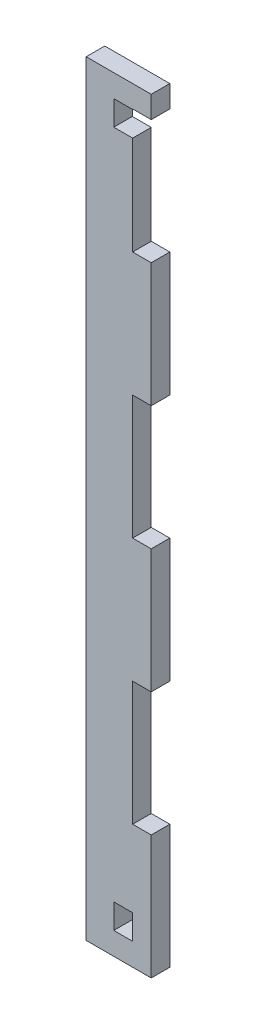
ISO-10303-21;
HEADER;
FILE_DESCRIPTION(('STEP AP214'),'2;1');
FILE_NAME('part.step','',(''),(''),'','','');
FILE_SCHEMA(('AUTOMOTIVE_DESIGN { 1 0 10303 214 1 1 1 1 }'));
ENDSEC;
DATA;
#1=APPLICATION_CONTEXT('core data for automotive mechanical design processes');
#2=APPLICATION_PROTOCOL_DEFINITION('international standard','automotive_design',2000,#1);
#3=PRODUCT_CONTEXT('',#1,'mechanical');
#4=PRODUCT('Part','Part','',(#3));
#5=PRODUCT_RELATED_PRODUCT_CATEGORY('part','',(#4));
#6=PRODUCT_DEFINITION_FORMATION('','',#4);
#7=PRODUCT_DEFINITION_CONTEXT('part definition',#1,'design');
#8=PRODUCT_DEFINITION('design','',#6,#7);
#9=PRODUCT_DEFINITION_SHAPE('','',#8);
#10=(LENGTH_UNIT() NAMED_UNIT(*) SI_UNIT(.MILLI.,.METRE.));
#11=(NAMED_UNIT(*) PLANE_ANGLE_UNIT() SI_UNIT($,.RADIAN.));
#12=(NAMED_UNIT(*) SI_UNIT($,.STERADIAN.) SOLID_ANGLE_UNIT());
#13=UNCERTAINTY_MEASURE_WITH_UNIT(LENGTH_MEASURE(1.E-05),#10,'distance_accuracy_value','');
#14=(GEOMETRIC_REPRESENTATION_CONTEXT(3) GLOBAL_UNCERTAINTY_ASSIGNED_CONTEXT((#13)) GLOBAL_UNIT_ASSIGNED_CONTEXT((#10,
#11,#12)) REPRESENTATION_CONTEXT('',''));
#15=CARTESIAN_POINT('',(0.,0.,0.));
#16=DIRECTION('',(0.,0.,1.));
#17=DIRECTION('',(1.,0.,0.));
#18=AXIS2_PLACEMENT_3D('',#15,#16,#17);
#19=CARTESIAN_POINT('',(0.,0.,6.));
#20=DIRECTION('',(0.,0.,1.));
#21=DIRECTION('',(1.,0.,0.));
#22=AXIS2_PLACEMENT_3D('',#19,#20,#21);
#23=PLANE('',#22);
#24=DIRECTION('',(0.,-1.,0.));
#25=VECTOR('',#24,1.);
#26=CARTESIAN_POINT('',(-15.,181.409908734667,6.));
#27=LINE('',#26,#25);
#28=CARTESIAN_POINT('',(-15.,181.409908734667,6.));
#29=VERTEX_POINT('',#28);
#30=CARTESIAN_POINT('',(-14.9999999999999,-65.6931909968825,6.));
#31=VERTEX_POINT('',#30);
#32=EDGE_CURVE('E229',#29,#31,#27,.T.);
#33=ORIENTED_EDGE('',*,*,#32,.T.);
#34=DIRECTION('',(1.,0.,0.));
#35=VECTOR('',#34,1.);
#36=CARTESIAN_POINT('',(-14.9999999999999,-65.6931909968825,6.));
#37=LINE('',#36,#35);
#38=CARTESIAN_POINT('',(6.,-65.6931909968825,6.));
#39=VERTEX_POINT('',#38);
#40=EDGE_CURVE('E232',#31,#39,#37,.T.);
#41=ORIENTED_EDGE('',*,*,#40,.T.);
#42=DIRECTION('',(0.,1.,0.));
#43=VECTOR('',#42,1.);
#44=CARTESIAN_POINT('',(6.,-25.6919761374717,6.));
#45=LINE('',#44,#43);
#46=CARTESIAN_POINT('',(6.,-25.6919761374717,6.));
#47=VERTEX_POINT('',#46);
#48=EDGE_CURVE('E235',#39,#47,#45,.T.);
#49=ORIENTED_EDGE('',*,*,#48,.T.);
#50=DIRECTION('',(-1.,0.,0.));
#51=VECTOR('',#50,1.);
#52=CARTESIAN_POINT('',(0.,-25.6919761374717,6.));
#53=LINE('',#52,#51);
#54=CARTESIAN_POINT('',(0.,-25.6919761374717,6.));
#55=VERTEX_POINT('',#54);
#56=EDGE_CURVE('E237',#47,#55,#53,.T.);
#57=ORIENTED_EDGE('',*,*,#56,.T.);
#58=DIRECTION('',(0.,1.,0.));
#59=VECTOR('',#58,1.);
#60=CARTESIAN_POINT('',(0.,14.3068090031147,6.));
#61=LINE('',#60,#59);
#62=CARTESIAN_POINT('',(0.,14.3068090031147,6.));
#63=VERTEX_POINT('',#62);
#64=EDGE_CURVE('E239',#55,#63,#61,.T.);
#65=ORIENTED_EDGE('',*,*,#64,.T.);
#66=DIRECTION('',(1.,0.,0.));
#67=VECTOR('',#66,1.);
#68=CARTESIAN_POINT('',(6.,14.3068090031147,6.));
#69=LINE('',#68,#67);
#70=CARTESIAN_POINT('',(6.,14.3068090031147,6.));
#71=VERTEX_POINT('',#70);
#72=EDGE_CURVE('E241',#63,#71,#69,.T.);
#73=ORIENTED_EDGE('',*,*,#72,.T.);
#74=DIRECTION('',(0.,1.,0.));
#75=VECTOR('',#74,1.);
#76=CARTESIAN_POINT('',(6.,54.308631292235,6.));
#77=LINE('',#76,#75);
#78=CARTESIAN_POINT('',(6.,54.308631292235,6.));
#79=VERTEX_POINT('',#78);
#80=EDGE_CURVE('E243',#71,#79,#77,.T.);
#81=ORIENTED_EDGE('',*,*,#80,.T.);
#82=DIRECTION('',(-1.,0.,0.));
#83=VECTOR('',#82,1.);
#84=CARTESIAN_POINT('',(0.,54.308631292235,6.));
#85=LINE('',#84,#83);
#86=CARTESIAN_POINT('',(0.,54.308631292235,6.));
#87=VERTEX_POINT('',#86);
#88=EDGE_CURVE('E245',#79,#87,#85,.T.);
#89=ORIENTED_EDGE('',*,*,#88,.T.);
#90=DIRECTION('',(0.,1.,0.));
#91=VECTOR('',#90,1.);
#92=CARTESIAN_POINT('',(0.,94.3074164328215,6.));
#93=LINE('',#92,#91);
#94=CARTESIAN_POINT('',(0.,94.3074164328215,6.));
#95=VERTEX_POINT('',#94);
#96=EDGE_CURVE('E247',#87,#95,#93,.T.);
#97=ORIENTED_EDGE('',*,*,#96,.T.);
#98=DIRECTION('',(1.,0.,0.));
#99=VECTOR('',#98,1.);
#100=CARTESIAN_POINT('',(6.,94.3074164328215,6.));
#101=LINE('',#100,#99);
#102=CARTESIAN_POINT('',(6.,94.3074164328215,6.));
#103=VERTEX_POINT('',#102);
#104=EDGE_CURVE('E249',#95,#103,#101,.T.);
#105=ORIENTED_EDGE('',*,*,#104,.T.);
#106=DIRECTION('',(0.,1.,0.));
#107=VECTOR('',#106,1.);
#108=CARTESIAN_POINT('',(6.,134.309238721942,6.));
#109=LINE('',#108,#107);
#110=CARTESIAN_POINT('',(6.,134.309238721942,6.));
#111=VERTEX_POINT('',#110);
#112=EDGE_CURVE('E251',#103,#111,#109,.T.);
#113=ORIENTED_EDGE('',*,*,#112,.T.);
#114=DIRECTION('',(-1.,0.,0.));
#115=VECTOR('',#114,1.);
#116=CARTESIAN_POINT('',(0.,134.309238721942,6.));
#117=LINE('',#116,#115);
#118=CARTESIAN_POINT('',(0.,134.309238721942,6.));
#119=VERTEX_POINT('',#118);
#120=EDGE_CURVE('E253',#111,#119,#117,.T.);
#121=ORIENTED_EDGE('',*,*,#120,.T.);
#122=DIRECTION('',(0.,1.,0.));
#123=VECTOR('',#122,1.);
#124=CARTESIAN_POINT('',(0.,166.159908734665,6.));
#125=LINE('',#124,#123);
#126=CARTESIAN_POINT('',(0.,166.159908734665,6.));
#127=VERTEX_POINT('',#126);
#128=EDGE_CURVE('E255',#119,#127,#125,.T.);
#129=ORIENTED_EDGE('',*,*,#128,.T.);
#130=DIRECTION('',(-1.,0.,0.));
#131=VECTOR('',#130,1.);
#132=CARTESIAN_POINT('',(0.,166.159908734665,6.));
#133=LINE('',#132,#131);
#134=CARTESIAN_POINT('',(-6.1,166.159908734665,6.));
#135=VERTEX_POINT('',#134);
#136=EDGE_CURVE('E257',#127,#135,#133,.T.);
#137=ORIENTED_EDGE('',*,*,#136,.T.);
#138=DIRECTION('',(0.,1.,0.));
#139=VECTOR('',#138,1.);
#140=CARTESIAN_POINT('',(-6.1,166.159908734665,6.));
#141=LINE('',#140,#139);
#142=CARTESIAN_POINT('',(-6.1,174.159908734665,6.));
#143=VERTEX_POINT('',#142);
#144=EDGE_CURVE('E259',#135,#143,#141,.T.);
#145=ORIENTED_EDGE('',*,*,#144,.T.);
#146=DIRECTION('',(1.,0.,0.));
#147=VECTOR('',#146,1.);
#148=CARTESIAN_POINT('',(0.,174.159908734665,6.));
#149=LINE('',#148,#147);
#150=CARTESIAN_POINT('',(0.,174.159908734665,6.));
#151=VERTEX_POINT('',#150);
#152=EDGE_CURVE('E261',#143,#151,#149,.T.);
#153=ORIENTED_EDGE('',*,*,#152,.T.);
#154=DIRECTION('',(0.,1.,0.));
#155=VECTOR('',#154,1.);
#156=CARTESIAN_POINT('',(0.,174.308023862528,6.));
#157=LINE('',#156,#155);
#158=CARTESIAN_POINT('',(0.,174.308023862528,6.));
#159=VERTEX_POINT('',#158);
#160=EDGE_CURVE('E263',#151,#159,#157,.T.);
#161=ORIENTED_EDGE('',*,*,#160,.T.);
#162=DIRECTION('',(1.,0.,0.));
#163=VECTOR('',#162,1.);
#164=CARTESIAN_POINT('',(6.,174.308023862528,6.));
#165=LINE('',#164,#163);
#166=CARTESIAN_POINT('',(6.,174.308023862528,6.));
#167=VERTEX_POINT('',#166);
#168=EDGE_CURVE('E265',#159,#167,#165,.T.);
#169=ORIENTED_EDGE('',*,*,#168,.T.);
#170=DIRECTION('',(0.,1.,0.));
#171=VECTOR('',#170,1.);
#172=CARTESIAN_POINT('',(5.99999999999997,181.409908734667,6.));
#173=LINE('',#172,#171);
#174=CARTESIAN_POINT('',(5.99999999999997,181.409908734667,6.));
#175=VERTEX_POINT('',#174);
#176=EDGE_CURVE('E267',#167,#175,#173,.T.);
#177=ORIENTED_EDGE('',*,*,#176,.T.);
#178=DIRECTION('',(-1.,0.,0.));
#179=VECTOR('',#178,1.);
#180=CARTESIAN_POINT('',(-15.,181.409908734667,6.));
#181=LINE('',#180,#179);
#182=EDGE_CURVE('E269',#175,#29,#181,.T.);
#183=ORIENTED_EDGE('',*,*,#182,.T.);
#184=EDGE_LOOP('',(#33,#41,#49,#57,#65,#73,#81,#89,#97,#105,#113,#121,#129,#137,#145,#153,#161,
#169,#177,#183));
#185=FACE_BOUND('',#184,.T.);
#186=DIRECTION('',(-1.,0.,0.));
#187=VECTOR('',#186,1.);
#188=CARTESIAN_POINT('',(0.,-50.4431909968838,6.));
#189=LINE('',#188,#187);
#190=CARTESIAN_POINT('',(0.,-50.4431909968838,6.));
#191=VERTEX_POINT('',#190);
#192=CARTESIAN_POINT('',(-6.1,-50.4431909968838,6.));
#193=VERTEX_POINT('',#192);
#194=EDGE_CURVE('E201',#191,#193,#189,.T.);
#195=ORIENTED_EDGE('',*,*,#194,.F.);
#196=DIRECTION('',(0.,1.,0.));
#197=VECTOR('',#196,1.);
#198=CARTESIAN_POINT('',(0.,-58.443190996884,6.));
#199=LINE('',#198,#197);
#200=CARTESIAN_POINT('',(0.,-58.443190996884,6.));
#201=VERTEX_POINT('',#200);
#202=EDGE_CURVE('E193',#201,#191,#199,.T.);
#203=ORIENTED_EDGE('',*,*,#202,.F.);
#204=DIRECTION('',(1.,0.,0.));
#205=VECTOR('',#204,1.);
#206=CARTESIAN_POINT('',(0.,-58.443190996884,6.));
#207=LINE('',#206,#205);
#208=CARTESIAN_POINT('',(-6.1,-58.443190996884,6.));
#209=VERTEX_POINT('',#208);
#210=EDGE_CURVE('E215',#209,#201,#207,.T.);
#211=ORIENTED_EDGE('',*,*,#210,.F.);
#212=DIRECTION('',(0.,-1.,0.));
#213=VECTOR('',#212,1.);
#214=CARTESIAN_POINT('',(-6.1,-50.4431909968838,6.));
#215=LINE('',#214,#213);
#216=EDGE_CURVE('E213',#193,#209,#215,.T.);
#217=ORIENTED_EDGE('',*,*,#216,.F.);
#218=EDGE_LOOP('',(#195,#203,#211,#217));
#219=FACE_BOUND('',#218,.T.);
#220=ADVANCED_FACE('F32',(#185,#219),#23,.T.);
#221=CARTESIAN_POINT('',(0.,0.,0.));
#222=DIRECTION('',(0.,0.,1.));
#223=DIRECTION('',(1.,0.,0.));
#224=AXIS2_PLACEMENT_3D('',#221,#222,#223);
#225=PLANE('',#224);
#226=DIRECTION('',(0.,-1.,0.));
#227=VECTOR('',#226,1.);
#228=CARTESIAN_POINT('',(-15.,181.409908734667,0.));
#229=LINE('',#228,#227);
#230=CARTESIAN_POINT('',(-15.,181.409908734667,0.));
#231=VERTEX_POINT('',#230);
#232=CARTESIAN_POINT('',(-14.9999999999999,-65.6931909968825,0.));
#233=VERTEX_POINT('',#232);
#234=EDGE_CURVE('E209',#231,#233,#229,.T.);
#235=ORIENTED_EDGE('',*,*,#234,.F.);
#236=DIRECTION('',(-1.,0.,0.));
#237=VECTOR('',#236,1.);
#238=CARTESIAN_POINT('',(-15.,181.409908734667,0.));
#239=LINE('',#238,#237);
#240=CARTESIAN_POINT('',(5.99999999999997,181.409908734667,0.));
#241=VERTEX_POINT('',#240);
#242=EDGE_CURVE('E233',#241,#231,#239,.T.);
#243=ORIENTED_EDGE('',*,*,#242,.F.);
#244=DIRECTION('',(0.,1.,0.));
#245=VECTOR('',#244,1.);
#246=CARTESIAN_POINT('',(5.99999999999997,181.409908734667,0.));
#247=LINE('',#246,#245);
#248=CARTESIAN_POINT('',(6.,174.308023862528,0.));
#249=VERTEX_POINT('',#248);
#250=EDGE_CURVE('E308',#249,#241,#247,.T.);
#251=ORIENTED_EDGE('',*,*,#250,.F.);
#252=DIRECTION('',(1.,0.,0.));
#253=VECTOR('',#252,1.);
#254=CARTESIAN_POINT('',(6.,174.308023862528,0.));
#255=LINE('',#254,#253);
#256=CARTESIAN_POINT('',(0.,174.308023862528,0.));
#257=VERTEX_POINT('',#256);
#258=EDGE_CURVE('E306',#257,#249,#255,.T.);
#259=ORIENTED_EDGE('',*,*,#258,.F.);
#260=DIRECTION('',(0.,1.,0.));
#261=VECTOR('',#260,1.);
#262=CARTESIAN_POINT('',(0.,174.308023862528,0.));
#263=LINE('',#262,#261);
#264=CARTESIAN_POINT('',(0.,174.159908734665,0.));
#265=VERTEX_POINT('',#264);
#266=EDGE_CURVE('E304',#265,#257,#263,.T.);
#267=ORIENTED_EDGE('',*,*,#266,.F.);
#268=DIRECTION('',(1.,0.,0.));
#269=VECTOR('',#268,1.);
#270=CARTESIAN_POINT('',(0.,174.159908734665,0.));
#271=LINE('',#270,#269);
#272=CARTESIAN_POINT('',(-6.1,174.159908734665,0.));
#273=VERTEX_POINT('',#272);
#274=EDGE_CURVE('E302',#273,#265,#271,.T.);
#275=ORIENTED_EDGE('',*,*,#274,.F.);
#276=DIRECTION('',(0.,1.,0.));
#277=VECTOR('',#276,1.);
#278=CARTESIAN_POINT('',(-6.1,166.159908734665,0.));
#279=LINE('',#278,#277);
#280=CARTESIAN_POINT('',(-6.1,166.159908734665,0.));
#281=VERTEX_POINT('',#280);
#282=EDGE_CURVE('E300',#281,#273,#279,.T.);
#283=ORIENTED_EDGE('',*,*,#282,.F.);
#284=DIRECTION('',(-1.,0.,0.));
#285=VECTOR('',#284,1.);
#286=CARTESIAN_POINT('',(0.,166.159908734665,0.));
#287=LINE('',#286,#285);
#288=CARTESIAN_POINT('',(0.,166.159908734665,0.));
#289=VERTEX_POINT('',#288);
#290=EDGE_CURVE('E298',#289,#281,#287,.T.);
#291=ORIENTED_EDGE('',*,*,#290,.F.);
#292=DIRECTION('',(0.,1.,0.));
#293=VECTOR('',#292,1.);
#294=CARTESIAN_POINT('',(0.,166.159908734665,0.));
#295=LINE('',#294,#293);
#296=CARTESIAN_POINT('',(0.,134.309238721942,0.));
#297=VERTEX_POINT('',#296);
#298=EDGE_CURVE('E296',#297,#289,#295,.T.);
#299=ORIENTED_EDGE('',*,*,#298,.F.);
#300=DIRECTION('',(-1.,0.,0.));
#301=VECTOR('',#300,1.);
#302=CARTESIAN_POINT('',(0.,134.309238721942,0.));
#303=LINE('',#302,#301);
#304=CARTESIAN_POINT('',(6.,134.309238721942,0.));
#305=VERTEX_POINT('',#304);
#306=EDGE_CURVE('E294',#305,#297,#303,.T.);
#307=ORIENTED_EDGE('',*,*,#306,.F.);
#308=DIRECTION('',(0.,1.,0.));
#309=VECTOR('',#308,1.);
#310=CARTESIAN_POINT('',(6.,134.309238721942,0.));
#311=LINE('',#310,#309);
#312=CARTESIAN_POINT('',(6.,94.3074164328215,0.));
#313=VERTEX_POINT('',#312);
#314=EDGE_CURVE('E292',#313,#305,#311,.T.);
#315=ORIENTED_EDGE('',*,*,#314,.F.);
#316=DIRECTION('',(1.,0.,0.));
#317=VECTOR('',#316,1.);
#318=CARTESIAN_POINT('',(6.,94.3074164328215,0.));
#319=LINE('',#318,#317);
#320=CARTESIAN_POINT('',(0.,94.3074164328215,0.));
#321=VERTEX_POINT('',#320);
#322=EDGE_CURVE('E290',#321,#313,#319,.T.);
#323=ORIENTED_EDGE('',*,*,#322,.F.);
#324=DIRECTION('',(0.,1.,0.));
#325=VECTOR('',#324,1.);
#326=CARTESIAN_POINT('',(0.,94.3074164328215,0.));
#327=LINE('',#326,#325);
#328=CARTESIAN_POINT('',(0.,54.308631292235,0.));
#329=VERTEX_POINT('',#328);
#330=EDGE_CURVE('E288',#329,#321,#327,.T.);
#331=ORIENTED_EDGE('',*,*,#330,.F.);
#332=DIRECTION('',(-1.,0.,0.));
#333=VECTOR('',#332,1.);
#334=CARTESIAN_POINT('',(0.,54.308631292235,0.));
#335=LINE('',#334,#333);
#336=CARTESIAN_POINT('',(6.,54.308631292235,0.));
#337=VERTEX_POINT('',#336);
#338=EDGE_CURVE('E286',#337,#329,#335,.T.);
#339=ORIENTED_EDGE('',*,*,#338,.F.);
#340=DIRECTION('',(0.,1.,0.));
#341=VECTOR('',#340,1.);
#342=CARTESIAN_POINT('',(6.,54.308631292235,0.));
#343=LINE('',#342,#341);
#344=CARTESIAN_POINT('',(6.,14.3068090031147,0.));
#345=VERTEX_POINT('',#344);
#346=EDGE_CURVE('E284',#345,#337,#343,.T.);
#347=ORIENTED_EDGE('',*,*,#346,.F.);
#348=DIRECTION('',(1.,0.,0.));
#349=VECTOR('',#348,1.);
#350=CARTESIAN_POINT('',(6.,14.3068090031147,0.));
#351=LINE('',#350,#349);
#352=CARTESIAN_POINT('',(0.,14.3068090031147,0.));
#353=VERTEX_POINT('',#352);
#354=EDGE_CURVE('E282',#353,#345,#351,.T.);
#355=ORIENTED_EDGE('',*,*,#354,.F.);
#356=DIRECTION('',(0.,1.,0.));
#357=VECTOR('',#356,1.);
#358=CARTESIAN_POINT('',(0.,14.3068090031147,0.));
#359=LINE('',#358,#357);
#360=CARTESIAN_POINT('',(0.,-25.6919761374717,0.));
#361=VERTEX_POINT('',#360);
#362=EDGE_CURVE('E280',#361,#353,#359,.T.);
#363=ORIENTED_EDGE('',*,*,#362,.F.);
#364=DIRECTION('',(-1.,0.,0.));
#365=VECTOR('',#364,1.);
#366=CARTESIAN_POINT('',(0.,-25.6919761374717,0.));
#367=LINE('',#366,#365);
#368=CARTESIAN_POINT('',(6.,-25.6919761374717,0.));
#369=VERTEX_POINT('',#368);
#370=EDGE_CURVE('E278',#369,#361,#367,.T.);
#371=ORIENTED_EDGE('',*,*,#370,.F.);
#372=DIRECTION('',(0.,1.,0.));
#373=VECTOR('',#372,1.);
#374=CARTESIAN_POINT('',(6.,-25.6919761374717,0.));
#375=LINE('',#374,#373);
#376=CARTESIAN_POINT('',(6.,-65.6931909968825,0.));
#377=VERTEX_POINT('',#376);
#378=EDGE_CURVE('E276',#377,#369,#375,.T.);
#379=ORIENTED_EDGE('',*,*,#378,.F.);
#380=DIRECTION('',(1.,0.,0.));
#381=VECTOR('',#380,1.);
#382=CARTESIAN_POINT('',(-14.9999999999999,-65.6931909968825,0.));
#383=LINE('',#382,#381);
#384=EDGE_CURVE('E274',#233,#377,#383,.T.);
#385=ORIENTED_EDGE('',*,*,#384,.F.);
#386=EDGE_LOOP('',(#235,#243,#251,#259,#267,#275,#283,#291,#299,#307,#315,#323,#331,#339,#347,
#355,#363,#371,#379,#385));
#387=FACE_BOUND('',#386,.T.);
#388=DIRECTION('',(0.,1.,0.));
#389=VECTOR('',#388,1.);
#390=CARTESIAN_POINT('',(0.,-58.443190996884,0.));
#391=LINE('',#390,#389);
#392=CARTESIAN_POINT('',(0.,-58.443190996884,0.));
#393=VERTEX_POINT('',#392);
#394=CARTESIAN_POINT('',(0.,-50.4431909968838,0.));
#395=VERTEX_POINT('',#394);
#396=EDGE_CURVE('E55',#393,#395,#391,.T.);
#397=ORIENTED_EDGE('',*,*,#396,.T.);
#398=DIRECTION('',(-1.,0.,0.));
#399=VECTOR('',#398,1.);
#400=CARTESIAN_POINT('',(0.,-50.4431909968838,0.));
#401=LINE('',#400,#399);
#402=CARTESIAN_POINT('',(-6.1,-50.4431909968838,0.));
#403=VERTEX_POINT('',#402);
#404=EDGE_CURVE('E208',#395,#403,#401,.T.);
#405=ORIENTED_EDGE('',*,*,#404,.T.);
#406=DIRECTION('',(0.,-1.,0.));
#407=VECTOR('',#406,1.);
#408=CARTESIAN_POINT('',(-6.1,-50.4431909968838,0.));
#409=LINE('',#408,#407);
#410=CARTESIAN_POINT('',(-6.1,-58.443190996884,0.));
#411=VERTEX_POINT('',#410);
#412=EDGE_CURVE('E221',#403,#411,#409,.T.);
#413=ORIENTED_EDGE('',*,*,#412,.T.);
#414=DIRECTION('',(1.,0.,0.));
#415=VECTOR('',#414,1.);
#416=CARTESIAN_POINT('',(0.,-58.443190996884,0.));
#417=LINE('',#416,#415);
#418=EDGE_CURVE('E202',#411,#393,#417,.T.);
#419=ORIENTED_EDGE('',*,*,#418,.T.);
#420=EDGE_LOOP('',(#397,#405,#413,#419));
#421=FACE_BOUND('',#420,.T.);
#422=ADVANCED_FACE('F374',(#387,#421),#225,.F.);
#423=CARTESIAN_POINT('',(-15.,181.409908734667,6.));
#424=DIRECTION('',(1.,0.,0.));
#425=DIRECTION('',(0.,1.,0.));
#426=AXIS2_PLACEMENT_3D('',#423,#424,#425);
#427=PLANE('',#426);
#428=ORIENTED_EDGE('',*,*,#234,.T.);
#429=DIRECTION('',(0.,0.,-1.));
#430=VECTOR('',#429,1.);
#431=CARTESIAN_POINT('',(-14.9999999999999,-65.6931909968825,6.));
#432=LINE('',#431,#430);
#433=EDGE_CURVE('E11',#31,#233,#432,.T.);
#434=ORIENTED_EDGE('',*,*,#433,.F.);
#435=ORIENTED_EDGE('',*,*,#32,.F.);
#436=DIRECTION('',(0.,0.,-1.));
#437=VECTOR('',#436,1.);
#438=CARTESIAN_POINT('',(-15.,181.409908734667,6.));
#439=LINE('',#438,#437);
#440=EDGE_CURVE('E271',#29,#231,#439,.T.);
#441=ORIENTED_EDGE('',*,*,#440,.T.);
#442=EDGE_LOOP('',(#428,#434,#435,#441));
#443=FACE_BOUND('',#442,.T.);
#444=ADVANCED_FACE('F34',(#443),#427,.F.);
#445=CARTESIAN_POINT('',(-14.9999999999999,-65.6931909968825,6.));
#446=DIRECTION('',(0.,1.,0.));
#447=DIRECTION('',(0.,0.,1.));
#448=AXIS2_PLACEMENT_3D('',#445,#446,#447);
#449=PLANE('',#448);
#450=ORIENTED_EDGE('',*,*,#384,.T.);
#451=DIRECTION('',(0.,0.,-1.));
#452=VECTOR('',#451,1.);
#453=CARTESIAN_POINT('',(6.,-65.6931909968825,6.));
#454=LINE('',#453,#452);
#455=EDGE_CURVE('E40',#39,#377,#454,.T.);
#456=ORIENTED_EDGE('',*,*,#455,.F.);
#457=ORIENTED_EDGE('',*,*,#40,.F.);
#458=ORIENTED_EDGE('',*,*,#433,.T.);
#459=EDGE_LOOP('',(#450,#456,#457,#458));
#460=FACE_BOUND('',#459,.T.);
#461=ADVANCED_FACE('F391',(#460),#449,.F.);
#462=CARTESIAN_POINT('',(6.,-25.6919761374717,6.));
#463=DIRECTION('',(-1.,0.,0.));
#464=DIRECTION('',(0.,0.,1.));
#465=AXIS2_PLACEMENT_3D('',#462,#463,#464);
#466=PLANE('',#465);
#467=ORIENTED_EDGE('',*,*,#378,.T.);
#468=DIRECTION('',(0.,0.,-1.));
#469=VECTOR('',#468,1.);
#470=CARTESIAN_POINT('',(6.,-25.6919761374717,6.));
#471=LINE('',#470,#469);
#472=EDGE_CURVE('E361',#47,#369,#471,.T.);
#473=ORIENTED_EDGE('',*,*,#472,.F.);
#474=ORIENTED_EDGE('',*,*,#48,.F.);
#475=ORIENTED_EDGE('',*,*,#455,.T.);
#476=EDGE_LOOP('',(#467,#473,#474,#475));
#477=FACE_BOUND('',#476,.T.);
#478=ADVANCED_FACE('F368',(#477),#466,.F.);
#479=CARTESIAN_POINT('',(0.,-25.6919761374717,6.));
#480=DIRECTION('',(0.,-1.,0.));
#481=DIRECTION('',(0.,0.,-1.));
#482=AXIS2_PLACEMENT_3D('',#479,#480,#481);
#483=PLANE('',#482);
#484=ORIENTED_EDGE('',*,*,#370,.T.);
#485=DIRECTION('',(0.,0.,-1.));
#486=VECTOR('',#485,1.);
#487=CARTESIAN_POINT('',(0.,-25.6919761374717,6.));
#488=LINE('',#487,#486);
#489=EDGE_CURVE('E358',#55,#361,#488,.T.);
#490=ORIENTED_EDGE('',*,*,#489,.F.);
#491=ORIENTED_EDGE('',*,*,#56,.F.);
#492=ORIENTED_EDGE('',*,*,#472,.T.);
#493=EDGE_LOOP('',(#484,#490,#491,#492));
#494=FACE_BOUND('',#493,.T.);
#495=ADVANCED_FACE('F380',(#494),#483,.F.);
#496=CARTESIAN_POINT('',(0.,14.3068090031147,6.));
#497=DIRECTION('',(-1.,0.,0.));
#498=DIRECTION('',(0.,-1.,0.));
#499=AXIS2_PLACEMENT_3D('',#496,#497,#498);
#500=PLANE('',#499);
#501=ORIENTED_EDGE('',*,*,#362,.T.);
#502=DIRECTION('',(0.,0.,-1.));
#503=VECTOR('',#502,1.);
#504=CARTESIAN_POINT('',(0.,14.3068090031147,6.));
#505=LINE('',#504,#503);
#506=EDGE_CURVE('E355',#63,#353,#505,.T.);
#507=ORIENTED_EDGE('',*,*,#506,.F.);
#508=ORIENTED_EDGE('',*,*,#64,.F.);
#509=ORIENTED_EDGE('',*,*,#489,.T.);
#510=EDGE_LOOP('',(#501,#507,#508,#509));
#511=FACE_BOUND('',#510,.T.);
#512=ADVANCED_FACE('F384',(#511),#500,.F.);
#513=CARTESIAN_POINT('',(6.,14.3068090031147,6.));
#514=DIRECTION('',(0.,1.,0.));
#515=DIRECTION('',(0.,0.,1.));
#516=AXIS2_PLACEMENT_3D('',#513,#514,#515);
#517=PLANE('',#516);
#518=ORIENTED_EDGE('',*,*,#354,.T.);
#519=DIRECTION('',(0.,0.,-1.));
#520=VECTOR('',#519,1.);
#521=CARTESIAN_POINT('',(6.,14.3068090031147,6.));
#522=LINE('',#521,#520);
#523=EDGE_CURVE('E352',#71,#345,#522,.T.);
#524=ORIENTED_EDGE('',*,*,#523,.F.);
#525=ORIENTED_EDGE('',*,*,#72,.F.);
#526=ORIENTED_EDGE('',*,*,#506,.T.);
#527=EDGE_LOOP('',(#518,#524,#525,#526));
#528=FACE_BOUND('',#527,.T.);
#529=ADVANCED_FACE('F464',(#528),#517,.F.);
#530=CARTESIAN_POINT('',(6.,54.308631292235,6.));
#531=DIRECTION('',(-1.,0.,0.));
#532=DIRECTION('',(0.,0.,1.));
#533=AXIS2_PLACEMENT_3D('',#530,#531,#532);
#534=PLANE('',#533);
#535=ORIENTED_EDGE('',*,*,#346,.T.);
#536=DIRECTION('',(0.,0.,-1.));
#537=VECTOR('',#536,1.);
#538=CARTESIAN_POINT('',(6.,54.308631292235,6.));
#539=LINE('',#538,#537);
#540=EDGE_CURVE('E349',#79,#337,#539,.T.);
#541=ORIENTED_EDGE('',*,*,#540,.F.);
#542=ORIENTED_EDGE('',*,*,#80,.F.);
#543=ORIENTED_EDGE('',*,*,#523,.T.);
#544=EDGE_LOOP('',(#535,#541,#542,#543));
#545=FACE_BOUND('',#544,.T.);
#546=ADVANCED_FACE('F462',(#545),#534,.F.);
#547=CARTESIAN_POINT('',(0.,54.308631292235,6.));
#548=DIRECTION('',(0.,-1.,0.));
#549=DIRECTION('',(0.,0.,-1.));
#550=AXIS2_PLACEMENT_3D('',#547,#548,#549);
#551=PLANE('',#550);
#552=ORIENTED_EDGE('',*,*,#338,.T.);
#553=DIRECTION('',(0.,0.,-1.));
#554=VECTOR('',#553,1.);
#555=CARTESIAN_POINT('',(0.,54.308631292235,6.));
#556=LINE('',#555,#554);
#557=EDGE_CURVE('E346',#87,#329,#556,.T.);
#558=ORIENTED_EDGE('',*,*,#557,.F.);
#559=ORIENTED_EDGE('',*,*,#88,.F.);
#560=ORIENTED_EDGE('',*,*,#540,.T.);
#561=EDGE_LOOP('',(#552,#558,#559,#560));
#562=FACE_BOUND('',#561,.T.);
#563=ADVANCED_FACE('F457',(#562),#551,.F.);
#564=CARTESIAN_POINT('',(0.,94.3074164328215,6.));
#565=DIRECTION('',(-1.,0.,0.));
#566=DIRECTION('',(0.,0.,1.));
#567=AXIS2_PLACEMENT_3D('',#564,#565,#566);
#568=PLANE('',#567);
#569=ORIENTED_EDGE('',*,*,#330,.T.);
#570=DIRECTION('',(0.,0.,-1.));
#571=VECTOR('',#570,1.);
#572=CARTESIAN_POINT('',(0.,94.3074164328215,6.));
#573=LINE('',#572,#571);
#574=EDGE_CURVE('E343',#95,#321,#573,.T.);
#575=ORIENTED_EDGE('',*,*,#574,.F.);
#576=ORIENTED_EDGE('',*,*,#96,.F.);
#577=ORIENTED_EDGE('',*,*,#557,.T.);
#578=EDGE_LOOP('',(#569,#575,#576,#577));
#579=FACE_BOUND('',#578,.T.);
#580=ADVANCED_FACE('F452',(#579),#568,.F.);
#581=CARTESIAN_POINT('',(6.,94.3074164328215,6.));
#582=DIRECTION('',(0.,1.,0.));
#583=DIRECTION('',(0.,0.,1.));
#584=AXIS2_PLACEMENT_3D('',#581,#582,#583);
#585=PLANE('',#584);
#586=ORIENTED_EDGE('',*,*,#322,.T.);
#587=DIRECTION('',(0.,0.,-1.));
#588=VECTOR('',#587,1.);
#589=CARTESIAN_POINT('',(6.,94.3074164328215,6.));
#590=LINE('',#589,#588);
#591=EDGE_CURVE('E340',#103,#313,#590,.T.);
#592=ORIENTED_EDGE('',*,*,#591,.F.);
#593=ORIENTED_EDGE('',*,*,#104,.F.);
#594=ORIENTED_EDGE('',*,*,#574,.T.);
#595=EDGE_LOOP('',(#586,#592,#593,#594));
#596=FACE_BOUND('',#595,.T.);
#597=ADVANCED_FACE('F448',(#596),#585,.F.);
#598=CARTESIAN_POINT('',(6.,134.309238721942,6.));
#599=DIRECTION('',(-1.,0.,0.));
#600=DIRECTION('',(0.,0.,1.));
#601=AXIS2_PLACEMENT_3D('',#598,#599,#600);
#602=PLANE('',#601);
#603=ORIENTED_EDGE('',*,*,#314,.T.);
#604=DIRECTION('',(0.,0.,-1.));
#605=VECTOR('',#604,1.);
#606=CARTESIAN_POINT('',(6.,134.309238721942,6.));
#607=LINE('',#606,#605);
#608=EDGE_CURVE('E337',#111,#305,#607,.T.);
#609=ORIENTED_EDGE('',*,*,#608,.F.);
#610=ORIENTED_EDGE('',*,*,#112,.F.);
#611=ORIENTED_EDGE('',*,*,#591,.T.);
#612=EDGE_LOOP('',(#603,#609,#610,#611));
#613=FACE_BOUND('',#612,.T.);
#614=ADVANCED_FACE('F443',(#613),#602,.F.);
#615=CARTESIAN_POINT('',(0.,134.309238721942,6.));
#616=DIRECTION('',(0.,-1.,0.));
#617=DIRECTION('',(0.,0.,-1.));
#618=AXIS2_PLACEMENT_3D('',#615,#616,#617);
#619=PLANE('',#618);
#620=ORIENTED_EDGE('',*,*,#306,.T.);
#621=DIRECTION('',(0.,0.,-1.));
#622=VECTOR('',#621,1.);
#623=CARTESIAN_POINT('',(0.,134.309238721942,6.));
#624=LINE('',#623,#622);
#625=EDGE_CURVE('E334',#119,#297,#624,.T.);
#626=ORIENTED_EDGE('',*,*,#625,.F.);
#627=ORIENTED_EDGE('',*,*,#120,.F.);
#628=ORIENTED_EDGE('',*,*,#608,.T.);
#629=EDGE_LOOP('',(#620,#626,#627,#628));
#630=FACE_BOUND('',#629,.T.);
#631=ADVANCED_FACE('F437',(#630),#619,.F.);
#632=CARTESIAN_POINT('',(0.,166.159908734665,6.));
#633=DIRECTION('',(-1.,0.,0.));
#634=DIRECTION('',(0.,-1.,0.));
#635=AXIS2_PLACEMENT_3D('',#632,#633,#634);
#636=PLANE('',#635);
#637=ORIENTED_EDGE('',*,*,#298,.T.);
#638=DIRECTION('',(0.,0.,-1.));
#639=VECTOR('',#638,1.);
#640=CARTESIAN_POINT('',(0.,166.159908734665,6.));
#641=LINE('',#640,#639);
#642=EDGE_CURVE('E331',#127,#289,#641,.T.);
#643=ORIENTED_EDGE('',*,*,#642,.F.);
#644=ORIENTED_EDGE('',*,*,#128,.F.);
#645=ORIENTED_EDGE('',*,*,#625,.T.);
#646=EDGE_LOOP('',(#637,#643,#644,#645));
#647=FACE_BOUND('',#646,.T.);
#648=ADVANCED_FACE('F433',(#647),#636,.F.);
#649=CARTESIAN_POINT('',(0.,166.159908734665,6.));
#650=DIRECTION('',(0.,-1.,0.));
#651=DIRECTION('',(0.,0.,-1.));
#652=AXIS2_PLACEMENT_3D('',#649,#650,#651);
#653=PLANE('',#652);
#654=ORIENTED_EDGE('',*,*,#290,.T.);
#655=DIRECTION('',(0.,0.,-1.));
#656=VECTOR('',#655,1.);
#657=CARTESIAN_POINT('',(-6.1,166.159908734665,6.));
#658=LINE('',#657,#656);
#659=EDGE_CURVE('E328',#135,#281,#658,.T.);
#660=ORIENTED_EDGE('',*,*,#659,.F.);
#661=ORIENTED_EDGE('',*,*,#136,.F.);
#662=ORIENTED_EDGE('',*,*,#642,.T.);
#663=EDGE_LOOP('',(#654,#660,#661,#662));
#664=FACE_BOUND('',#663,.T.);
#665=ADVANCED_FACE('F428',(#664),#653,.F.);
#666=CARTESIAN_POINT('',(-6.1,166.159908734665,6.));
#667=DIRECTION('',(-1.,0.,0.));
#668=DIRECTION('',(0.,0.,1.));
#669=AXIS2_PLACEMENT_3D('',#666,#667,#668);
#670=PLANE('',#669);
#671=ORIENTED_EDGE('',*,*,#282,.T.);
#672=DIRECTION('',(0.,0.,-1.));
#673=VECTOR('',#672,1.);
#674=CARTESIAN_POINT('',(-6.1,174.159908734665,6.));
#675=LINE('',#674,#673);
#676=EDGE_CURVE('E325',#143,#273,#675,.T.);
#677=ORIENTED_EDGE('',*,*,#676,.F.);
#678=ORIENTED_EDGE('',*,*,#144,.F.);
#679=ORIENTED_EDGE('',*,*,#659,.T.);
#680=EDGE_LOOP('',(#671,#677,#678,#679));
#681=FACE_BOUND('',#680,.T.);
#682=ADVANCED_FACE('F422',(#681),#670,.F.);
#683=CARTESIAN_POINT('',(0.,174.159908734665,6.));
#684=DIRECTION('',(0.,1.,0.));
#685=DIRECTION('',(0.,0.,1.));
#686=AXIS2_PLACEMENT_3D('',#683,#684,#685);
#687=PLANE('',#686);
#688=ORIENTED_EDGE('',*,*,#274,.T.);
#689=DIRECTION('',(0.,0.,-1.));
#690=VECTOR('',#689,1.);
#691=CARTESIAN_POINT('',(0.,174.159908734665,6.));
#692=LINE('',#691,#690);
#693=EDGE_CURVE('E322',#151,#265,#692,.T.);
#694=ORIENTED_EDGE('',*,*,#693,.F.);
#695=ORIENTED_EDGE('',*,*,#152,.F.);
#696=ORIENTED_EDGE('',*,*,#676,.T.);
#697=EDGE_LOOP('',(#688,#694,#695,#696));
#698=FACE_BOUND('',#697,.T.);
#699=ADVANCED_FACE('F418',(#698),#687,.F.);
#700=CARTESIAN_POINT('',(0.,174.308023862528,6.));
#701=DIRECTION('',(-1.,0.,0.));
#702=DIRECTION('',(0.,-1.,0.));
#703=AXIS2_PLACEMENT_3D('',#700,#701,#702);
#704=PLANE('',#703);
#705=ORIENTED_EDGE('',*,*,#266,.T.);
#706=DIRECTION('',(0.,0.,-1.));
#707=VECTOR('',#706,1.);
#708=CARTESIAN_POINT('',(0.,174.308023862528,6.));
#709=LINE('',#708,#707);
#710=EDGE_CURVE('E319',#159,#257,#709,.T.);
#711=ORIENTED_EDGE('',*,*,#710,.F.);
#712=ORIENTED_EDGE('',*,*,#160,.F.);
#713=ORIENTED_EDGE('',*,*,#693,.T.);
#714=EDGE_LOOP('',(#705,#711,#712,#713));
#715=FACE_BOUND('',#714,.T.);
#716=ADVANCED_FACE('F413',(#715),#704,.F.);
#717=CARTESIAN_POINT('',(6.,174.308023862528,6.));
#718=DIRECTION('',(0.,1.,0.));
#719=DIRECTION('',(0.,0.,1.));
#720=AXIS2_PLACEMENT_3D('',#717,#718,#719);
#721=PLANE('',#720);
#722=ORIENTED_EDGE('',*,*,#258,.T.);
#723=DIRECTION('',(0.,0.,-1.));
#724=VECTOR('',#723,1.);
#725=CARTESIAN_POINT('',(6.,174.308023862528,6.));
#726=LINE('',#725,#724);
#727=EDGE_CURVE('E316',#167,#249,#726,.T.);
#728=ORIENTED_EDGE('',*,*,#727,.F.);
#729=ORIENTED_EDGE('',*,*,#168,.F.);
#730=ORIENTED_EDGE('',*,*,#710,.T.);
#731=EDGE_LOOP('',(#722,#728,#729,#730));
#732=FACE_BOUND('',#731,.T.);
#733=ADVANCED_FACE('F407',(#732),#721,.F.);
#734=CARTESIAN_POINT('',(5.99999999999997,181.409908734667,6.));
#735=DIRECTION('',(-1.,0.,0.));
#736=DIRECTION('',(0.,-1.,0.));
#737=AXIS2_PLACEMENT_3D('',#734,#735,#736);
#738=PLANE('',#737);
#739=ORIENTED_EDGE('',*,*,#250,.T.);
#740=DIRECTION('',(0.,0.,-1.));
#741=VECTOR('',#740,1.);
#742=CARTESIAN_POINT('',(5.99999999999997,181.409908734667,6.));
#743=LINE('',#742,#741);
#744=EDGE_CURVE('E313',#175,#241,#743,.T.);
#745=ORIENTED_EDGE('',*,*,#744,.F.);
#746=ORIENTED_EDGE('',*,*,#176,.F.);
#747=ORIENTED_EDGE('',*,*,#727,.T.);
#748=EDGE_LOOP('',(#739,#745,#746,#747));
#749=FACE_BOUND('',#748,.T.);
#750=ADVANCED_FACE('F403',(#749),#738,.F.);
#751=CARTESIAN_POINT('',(-15.,181.409908734667,6.));
#752=DIRECTION('',(0.,-1.,0.));
#753=DIRECTION('',(0.,0.,-1.));
#754=AXIS2_PLACEMENT_3D('',#751,#752,#753);
#755=PLANE('',#754);
#756=ORIENTED_EDGE('',*,*,#242,.T.);
#757=ORIENTED_EDGE('',*,*,#440,.F.);
#758=ORIENTED_EDGE('',*,*,#182,.F.);
#759=ORIENTED_EDGE('',*,*,#744,.T.);
#760=EDGE_LOOP('',(#756,#757,#758,#759));
#761=FACE_BOUND('',#760,.T.);
#762=ADVANCED_FACE('F398',(#761),#755,.F.);
#763=CARTESIAN_POINT('',(0.,-58.443190996884,6.));
#764=DIRECTION('',(-1.,0.,0.));
#765=DIRECTION('',(0.,0.,1.));
#766=AXIS2_PLACEMENT_3D('',#763,#764,#765);
#767=PLANE('',#766);
#768=ORIENTED_EDGE('',*,*,#396,.F.);
#769=DIRECTION('',(0.,0.,-1.));
#770=VECTOR('',#769,1.);
#771=CARTESIAN_POINT('',(0.,-58.443190996884,6.));
#772=LINE('',#771,#770);
#773=EDGE_CURVE('E197',#201,#393,#772,.T.);
#774=ORIENTED_EDGE('',*,*,#773,.F.);
#775=ORIENTED_EDGE('',*,*,#202,.T.);
#776=DIRECTION('',(0.,0.,-1.));
#777=VECTOR('',#776,1.);
#778=CARTESIAN_POINT('',(0.,-50.4431909968838,6.));
#779=LINE('',#778,#777);
#780=EDGE_CURVE('E196',#191,#395,#779,.T.);
#781=ORIENTED_EDGE('',*,*,#780,.T.);
#782=EDGE_LOOP('',(#768,#774,#775,#781));
#783=FACE_BOUND('',#782,.T.);
#784=ADVANCED_FACE('F195',(#783),#767,.T.);
#785=CARTESIAN_POINT('',(0.,-50.4431909968838,6.));
#786=DIRECTION('',(0.,-1.,0.));
#787=DIRECTION('',(0.,0.,-1.));
#788=AXIS2_PLACEMENT_3D('',#785,#786,#787);
#789=PLANE('',#788);
#790=ORIENTED_EDGE('',*,*,#404,.F.);
#791=ORIENTED_EDGE('',*,*,#780,.F.);
#792=ORIENTED_EDGE('',*,*,#194,.T.);
#793=DIRECTION('',(0.,0.,-1.));
#794=VECTOR('',#793,1.);
#795=CARTESIAN_POINT('',(-6.1,-50.4431909968838,6.));
#796=LINE('',#795,#794);
#797=EDGE_CURVE('E210',#193,#403,#796,.T.);
#798=ORIENTED_EDGE('',*,*,#797,.T.);
#799=EDGE_LOOP('',(#790,#791,#792,#798));
#800=FACE_BOUND('',#799,.T.);
#801=ADVANCED_FACE('F205',(#800),#789,.T.);
#802=CARTESIAN_POINT('',(-6.1,-50.4431909968838,6.));
#803=DIRECTION('',(1.,0.,0.));
#804=DIRECTION('',(0.,1.,0.));
#805=AXIS2_PLACEMENT_3D('',#802,#803,#804);
#806=PLANE('',#805);
#807=ORIENTED_EDGE('',*,*,#412,.F.);
#808=ORIENTED_EDGE('',*,*,#797,.F.);
#809=ORIENTED_EDGE('',*,*,#216,.T.);
#810=DIRECTION('',(0.,0.,-1.));
#811=VECTOR('',#810,1.);
#812=CARTESIAN_POINT('',(-6.1,-58.443190996884,6.));
#813=LINE('',#812,#811);
#814=EDGE_CURVE('E47',#209,#411,#813,.T.);
#815=ORIENTED_EDGE('',*,*,#814,.T.);
#816=EDGE_LOOP('',(#807,#808,#809,#815));
#817=FACE_BOUND('',#816,.T.);
#818=ADVANCED_FACE('F570',(#817),#806,.T.);
#819=CARTESIAN_POINT('',(0.,-58.443190996884,6.));
#820=DIRECTION('',(0.,1.,0.));
#821=DIRECTION('',(0.,0.,1.));
#822=AXIS2_PLACEMENT_3D('',#819,#820,#821);
#823=PLANE('',#822);
#824=ORIENTED_EDGE('',*,*,#418,.F.);
#825=ORIENTED_EDGE('',*,*,#814,.F.);
#826=ORIENTED_EDGE('',*,*,#210,.T.);
#827=ORIENTED_EDGE('',*,*,#773,.T.);
#828=EDGE_LOOP('',(#824,#825,#826,#827));
#829=FACE_BOUND('',#828,.T.);
#830=ADVANCED_FACE('F576',(#829),#823,.T.);
#831=CLOSED_SHELL('',(#220,#422,#444,#461,#478,#495,#512,#529,#546,#563,#580,#597,#614,#631,
#648,#665,#682,#699,#716,#733,#750,#762,#784,#801,#818,#830));
#832=MANIFOLD_SOLID_BREP('B2',#831);
#833=ADVANCED_BREP_SHAPE_REPRESENTATION('',(#18,#832),#14);
#834=SHAPE_DEFINITION_REPRESENTATION(#9,#833);
ENDSEC;
END-ISO-10303-21;
